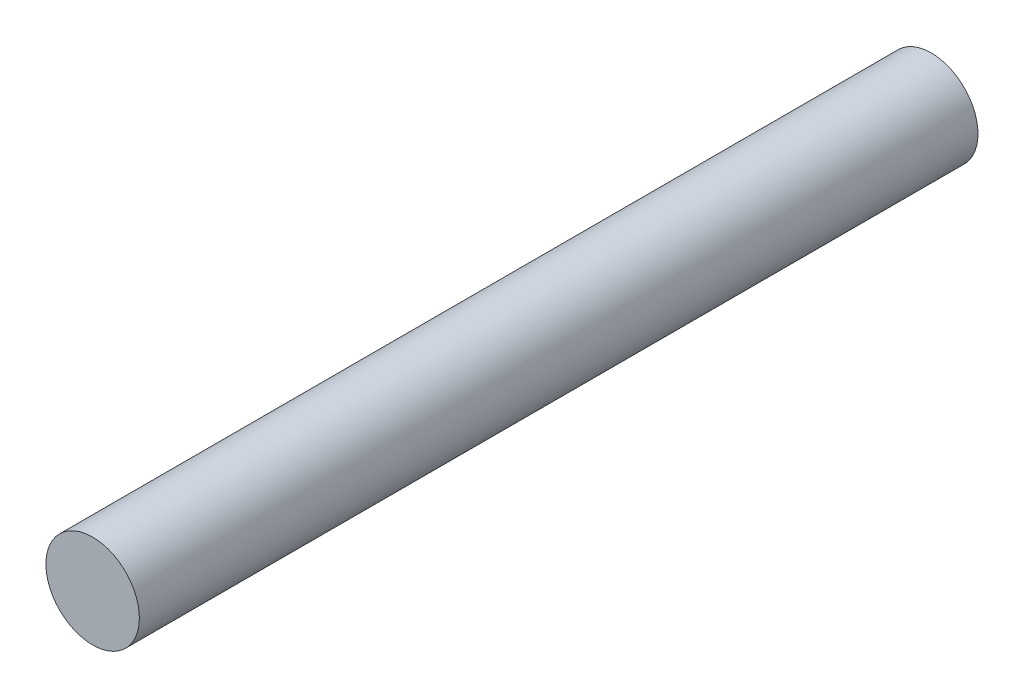
ISO-10303-21;
HEADER;
FILE_DESCRIPTION(('STEP AP214'),'2;1');
FILE_NAME('part.step','',(''),(''),'','','');
FILE_SCHEMA(('AUTOMOTIVE_DESIGN { 1 0 10303 214 1 1 1 1 }'));
ENDSEC;
DATA;
#1=APPLICATION_CONTEXT('core data for automotive mechanical design processes');
#2=APPLICATION_PROTOCOL_DEFINITION('international standard','automotive_design',2000,#1);
#3=PRODUCT_CONTEXT('',#1,'mechanical');
#4=PRODUCT('Part','Part','',(#3));
#5=PRODUCT_RELATED_PRODUCT_CATEGORY('part','',(#4));
#6=PRODUCT_DEFINITION_FORMATION('','',#4);
#7=PRODUCT_DEFINITION_CONTEXT('part definition',#1,'design');
#8=PRODUCT_DEFINITION('design','',#6,#7);
#9=PRODUCT_DEFINITION_SHAPE('','',#8);
#10=(LENGTH_UNIT() NAMED_UNIT(*) SI_UNIT(.MILLI.,.METRE.));
#11=(NAMED_UNIT(*) PLANE_ANGLE_UNIT() SI_UNIT($,.RADIAN.));
#12=(NAMED_UNIT(*) SI_UNIT($,.STERADIAN.) SOLID_ANGLE_UNIT());
#13=UNCERTAINTY_MEASURE_WITH_UNIT(LENGTH_MEASURE(1.E-05),#10,'distance_accuracy_value','');
#14=(GEOMETRIC_REPRESENTATION_CONTEXT(3) GLOBAL_UNCERTAINTY_ASSIGNED_CONTEXT((#13)) GLOBAL_UNIT_ASSIGNED_CONTEXT((#10,
#11,#12)) REPRESENTATION_CONTEXT('',''));
#15=CARTESIAN_POINT('',(0.,0.,0.));
#16=DIRECTION('',(0.,0.,1.));
#17=DIRECTION('',(1.,0.,0.));
#18=AXIS2_PLACEMENT_3D('',#15,#16,#17);
#19=CARTESIAN_POINT('',(0.,0.,35.));
#20=DIRECTION('',(0.,0.,-1.));
#21=DIRECTION('',(-1.,0.,0.));
#22=AXIS2_PLACEMENT_3D('',#19,#20,#21);
#23=CYLINDRICAL_SURFACE('',#22,1.95);
#24=CARTESIAN_POINT('',(0.,0.,35.));
#25=DIRECTION('',(0.,0.,1.));
#26=DIRECTION('',(1.,0.,0.));
#27=AXIS2_PLACEMENT_3D('',#24,#25,#26);
#28=CIRCLE('',#27,1.95);
#29=CARTESIAN_POINT('',(1.95,0.,35.));
#30=VERTEX_POINT('',#29);
#31=EDGE_CURVE('E10',#30,#30,#28,.T.);
#32=ORIENTED_EDGE('',*,*,#31,.F.);
#33=EDGE_LOOP('',(#32));
#34=FACE_BOUND('',#33,.T.);
#35=CARTESIAN_POINT('',(0.,0.,0.));
#36=DIRECTION('',(0.,0.,1.));
#37=DIRECTION('',(1.,0.,0.));
#38=AXIS2_PLACEMENT_3D('',#35,#36,#37);
#39=CIRCLE('',#38,1.95);
#40=CARTESIAN_POINT('',(1.95,0.,0.));
#41=VERTEX_POINT('',#40);
#42=EDGE_CURVE('E34',#41,#41,#39,.T.);
#43=ORIENTED_EDGE('',*,*,#42,.T.);
#44=EDGE_LOOP('',(#43));
#45=FACE_BOUND('',#44,.T.);
#46=ADVANCED_FACE('F31',(#34,#45),#23,.T.);
#47=CARTESIAN_POINT('',(0.,0.,35.));
#48=DIRECTION('',(0.,0.,1.));
#49=DIRECTION('',(1.,0.,0.));
#50=AXIS2_PLACEMENT_3D('',#47,#48,#49);
#51=PLANE('',#50);
#52=ORIENTED_EDGE('',*,*,#31,.T.);
#53=EDGE_LOOP('',(#52));
#54=FACE_BOUND('',#53,.T.);
#55=ADVANCED_FACE('F46',(#54),#51,.T.);
#56=CARTESIAN_POINT('',(0.,0.,0.));
#57=DIRECTION('',(0.,0.,1.));
#58=DIRECTION('',(1.,0.,0.));
#59=AXIS2_PLACEMENT_3D('',#56,#57,#58);
#60=PLANE('',#59);
#61=ORIENTED_EDGE('',*,*,#42,.F.);
#62=EDGE_LOOP('',(#61));
#63=FACE_BOUND('',#62,.T.);
#64=ADVANCED_FACE('F44',(#63),#60,.F.);
#65=CLOSED_SHELL('',(#46,#55,#64));
#66=MANIFOLD_SOLID_BREP('B2',#65);
#67=ADVANCED_BREP_SHAPE_REPRESENTATION('',(#18,#66),#14);
#68=SHAPE_DEFINITION_REPRESENTATION(#9,#67);
ENDSEC;
END-ISO-10303-21;
